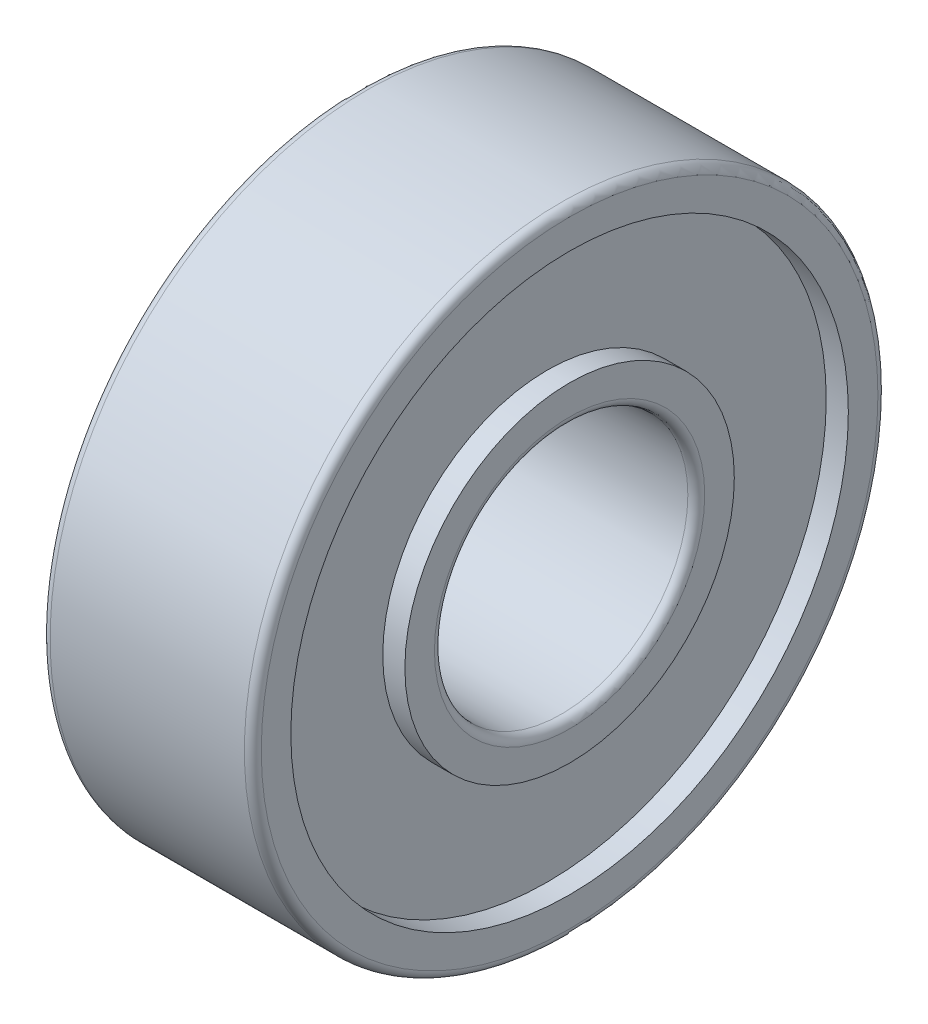
ISO-10303-21;
HEADER;
FILE_DESCRIPTION(('STEP AP214'),'2;1');
FILE_NAME('part.step','',(''),(''),'','','');
FILE_SCHEMA(('AUTOMOTIVE_DESIGN { 1 0 10303 214 1 1 1 1 }'));
ENDSEC;
DATA;
#1=APPLICATION_CONTEXT('core data for automotive mechanical design processes');
#2=APPLICATION_PROTOCOL_DEFINITION('international standard','automotive_design',2000,#1);
#3=PRODUCT_CONTEXT('',#1,'mechanical');
#4=PRODUCT('Part','Part','',(#3));
#5=PRODUCT_RELATED_PRODUCT_CATEGORY('part','',(#4));
#6=PRODUCT_DEFINITION_FORMATION('','',#4);
#7=PRODUCT_DEFINITION_CONTEXT('part definition',#1,'design');
#8=PRODUCT_DEFINITION('design','',#6,#7);
#9=PRODUCT_DEFINITION_SHAPE('','',#8);
#10=(LENGTH_UNIT() NAMED_UNIT(*) SI_UNIT(.MILLI.,.METRE.));
#11=(NAMED_UNIT(*) PLANE_ANGLE_UNIT() SI_UNIT($,.RADIAN.));
#12=(NAMED_UNIT(*) SI_UNIT($,.STERADIAN.) SOLID_ANGLE_UNIT());
#13=UNCERTAINTY_MEASURE_WITH_UNIT(LENGTH_MEASURE(1.E-05),#10,'distance_accuracy_value','');
#14=(GEOMETRIC_REPRESENTATION_CONTEXT(3) GLOBAL_UNCERTAINTY_ASSIGNED_CONTEXT((#13)) GLOBAL_UNIT_ASSIGNED_CONTEXT((#10,
#11,#12)) REPRESENTATION_CONTEXT('',''));
#15=CARTESIAN_POINT('',(0.,0.,0.));
#16=DIRECTION('',(0.,0.,1.));
#17=DIRECTION('',(1.,0.,0.));
#18=AXIS2_PLACEMENT_3D('',#15,#16,#17);
#19=CARTESIAN_POINT('',(-0.00134979776492058,0.,0.));
#20=DIRECTION('',(1.,0.,0.));
#21=DIRECTION('',(0.,0.,-1.));
#22=AXIS2_PLACEMENT_3D('',#19,#20,#21);
#23=CYLINDRICAL_SURFACE('',#22,3.9);
#24=CARTESIAN_POINT('',(0.,0.,0.));
#25=DIRECTION('',(1.,0.,0.));
#26=DIRECTION('',(0.,0.,-1.));
#27=AXIS2_PLACEMENT_3D('',#24,#25,#26);
#28=CIRCLE('',#27,3.9);
#29=CARTESIAN_POINT('',(0.,0.,-3.9));
#30=VERTEX_POINT('',#29);
#31=EDGE_CURVE('E10',#30,#30,#28,.T.);
#32=ORIENTED_EDGE('',*,*,#31,.T.);
#33=EDGE_LOOP('',(#32));
#34=FACE_BOUND('',#33,.T.);
#35=CARTESIAN_POINT('',(0.5235,0.,0.));
#36=DIRECTION('',(1.,0.,0.));
#37=DIRECTION('',(0.,0.,-1.));
#38=AXIS2_PLACEMENT_3D('',#35,#36,#37);
#39=CIRCLE('',#38,3.9);
#40=CARTESIAN_POINT('',(0.5235,0.,-3.9));
#41=VERTEX_POINT('',#40);
#42=EDGE_CURVE('E82',#41,#41,#39,.T.);
#43=ORIENTED_EDGE('',*,*,#42,.F.);
#44=EDGE_LOOP('',(#43));
#45=FACE_BOUND('',#44,.T.);
#46=ADVANCED_FACE('F30',(#34,#45),#23,.T.);
#47=CARTESIAN_POINT('',(0.,3.9,0.));
#48=DIRECTION('',(-1.,0.,0.));
#49=DIRECTION('',(0.,0.,1.));
#50=AXIS2_PLACEMENT_3D('',#47,#48,#49);
#51=PLANE('',#50);
#52=CARTESIAN_POINT('',(0.,0.,0.));
#53=DIRECTION('',(1.,0.,0.));
#54=DIRECTION('',(0.,0.,-1.));
#55=AXIS2_PLACEMENT_3D('',#52,#53,#54);
#56=CIRCLE('',#55,3.2);
#57=CARTESIAN_POINT('',(0.,0.,-3.2));
#58=VERTEX_POINT('',#57);
#59=EDGE_CURVE('E36',#58,#58,#56,.T.);
#60=ORIENTED_EDGE('',*,*,#59,.T.);
#61=EDGE_LOOP('',(#60));
#62=FACE_BOUND('',#61,.T.);
#63=ORIENTED_EDGE('',*,*,#31,.F.);
#64=EDGE_LOOP('',(#63));
#65=FACE_BOUND('',#64,.T.);
#66=ADVANCED_FACE('F90',(#62,#65),#51,.T.);
#67=CARTESIAN_POINT('',(0.200000000000015,0.,0.));
#68=DIRECTION('',(1.,0.,0.));
#69=DIRECTION('',(0.,0.,-1.));
#70=AXIS2_PLACEMENT_3D('',#67,#68,#69);
#71=TOROIDAL_SURFACE('',#70,3.2,0.200000000000016);
#72=CARTESIAN_POINT('',(0.2,0.,0.));
#73=DIRECTION('',(1.,0.,0.));
#74=DIRECTION('',(0.,0.,-1.));
#75=AXIS2_PLACEMENT_3D('',#72,#73,#74);
#76=CIRCLE('',#75,2.99999999999998);
#77=CARTESIAN_POINT('',(0.2,0.,-2.99999999999998));
#78=VERTEX_POINT('',#77);
#79=EDGE_CURVE('E40',#78,#78,#76,.T.);
#80=ORIENTED_EDGE('',*,*,#79,.T.);
#81=EDGE_LOOP('',(#80));
#82=FACE_BOUND('',#81,.T.);
#83=ORIENTED_EDGE('',*,*,#59,.F.);
#84=EDGE_LOOP('',(#83));
#85=FACE_BOUND('',#84,.T.);
#86=ADVANCED_FACE('F94',(#82,#85),#71,.T.);
#87=CARTESIAN_POINT('',(-0.00134979776492058,0.,0.));
#88=DIRECTION('',(1.,0.,0.));
#89=DIRECTION('',(0.,0.,-1.));
#90=AXIS2_PLACEMENT_3D('',#87,#88,#89);
#91=CYLINDRICAL_SURFACE('',#90,2.99999999999999);
#92=CARTESIAN_POINT('',(4.8,0.,0.));
#93=DIRECTION('',(1.,0.,0.));
#94=DIRECTION('',(0.,0.,-1.));
#95=AXIS2_PLACEMENT_3D('',#92,#93,#94);
#96=CIRCLE('',#95,3.);
#97=CARTESIAN_POINT('',(4.8,0.,-3.));
#98=VERTEX_POINT('',#97);
#99=EDGE_CURVE('E44',#98,#98,#96,.T.);
#100=ORIENTED_EDGE('',*,*,#99,.T.);
#101=EDGE_LOOP('',(#100));
#102=FACE_BOUND('',#101,.T.);
#103=ORIENTED_EDGE('',*,*,#79,.F.);
#104=EDGE_LOOP('',(#103));
#105=FACE_BOUND('',#104,.T.);
#106=ADVANCED_FACE('F98',(#102,#105),#91,.F.);
#107=CARTESIAN_POINT('',(4.8,0.,0.));
#108=DIRECTION('',(1.,0.,0.));
#109=DIRECTION('',(0.,0.,-1.));
#110=AXIS2_PLACEMENT_3D('',#107,#108,#109);
#111=TOROIDAL_SURFACE('',#110,3.2,0.200000000000016);
#112=CARTESIAN_POINT('',(5.00000000000002,0.,0.));
#113=DIRECTION('',(1.,0.,0.));
#114=DIRECTION('',(0.,0.,-1.));
#115=AXIS2_PLACEMENT_3D('',#112,#113,#114);
#116=CIRCLE('',#115,3.2);
#117=CARTESIAN_POINT('',(5.00000000000002,0.,-3.2));
#118=VERTEX_POINT('',#117);
#119=EDGE_CURVE('E49',#118,#118,#116,.T.);
#120=ORIENTED_EDGE('',*,*,#119,.T.);
#121=EDGE_LOOP('',(#120));
#122=FACE_BOUND('',#121,.T.);
#123=ORIENTED_EDGE('',*,*,#99,.F.);
#124=EDGE_LOOP('',(#123));
#125=FACE_BOUND('',#124,.T.);
#126=ADVANCED_FACE('F105',(#122,#125),#111,.T.);
#127=CARTESIAN_POINT('',(5.00000000000001,3.2,0.));
#128=DIRECTION('',(1.,0.,0.));
#129=DIRECTION('',(0.,0.,-1.));
#130=AXIS2_PLACEMENT_3D('',#127,#128,#129);
#131=PLANE('',#130);
#132=CARTESIAN_POINT('',(5.,0.,0.));
#133=DIRECTION('',(1.,0.,0.));
#134=DIRECTION('',(0.,0.,-1.));
#135=AXIS2_PLACEMENT_3D('',#132,#133,#134);
#136=CIRCLE('',#135,3.9);
#137=CARTESIAN_POINT('',(5.,0.,-3.9));
#138=VERTEX_POINT('',#137);
#139=EDGE_CURVE('E52',#138,#138,#136,.T.);
#140=ORIENTED_EDGE('',*,*,#139,.T.);
#141=EDGE_LOOP('',(#140));
#142=FACE_BOUND('',#141,.T.);
#143=ORIENTED_EDGE('',*,*,#119,.F.);
#144=EDGE_LOOP('',(#143));
#145=FACE_BOUND('',#144,.T.);
#146=ADVANCED_FACE('F109',(#142,#145),#131,.T.);
#147=CARTESIAN_POINT('',(-0.00134979776492058,0.,0.));
#148=DIRECTION('',(1.,0.,0.));
#149=DIRECTION('',(0.,0.,-1.));
#150=AXIS2_PLACEMENT_3D('',#147,#148,#149);
#151=CYLINDRICAL_SURFACE('',#150,3.9);
#152=CARTESIAN_POINT('',(4.4765,0.,0.));
#153=DIRECTION('',(1.,0.,0.));
#154=DIRECTION('',(0.,0.,-1.));
#155=AXIS2_PLACEMENT_3D('',#152,#153,#154);
#156=CIRCLE('',#155,3.9);
#157=CARTESIAN_POINT('',(4.4765,0.,-3.9));
#158=VERTEX_POINT('',#157);
#159=EDGE_CURVE('E55',#158,#158,#156,.T.);
#160=ORIENTED_EDGE('',*,*,#159,.T.);
#161=EDGE_LOOP('',(#160));
#162=FACE_BOUND('',#161,.T.);
#163=ORIENTED_EDGE('',*,*,#139,.F.);
#164=EDGE_LOOP('',(#163));
#165=FACE_BOUND('',#164,.T.);
#166=ADVANCED_FACE('F113',(#162,#165),#151,.T.);
#167=CARTESIAN_POINT('',(4.4765,3.9,0.));
#168=DIRECTION('',(1.,0.,0.));
#169=DIRECTION('',(0.,0.,-1.));
#170=AXIS2_PLACEMENT_3D('',#167,#168,#169);
#171=PLANE('',#170);
#172=CARTESIAN_POINT('',(4.4765,0.,0.));
#173=DIRECTION('',(1.,0.,0.));
#174=DIRECTION('',(0.,0.,-1.));
#175=AXIS2_PLACEMENT_3D('',#172,#173,#174);
#176=CIRCLE('',#175,6.6);
#177=CARTESIAN_POINT('',(4.4765,0.,-6.6));
#178=VERTEX_POINT('',#177);
#179=EDGE_CURVE('E58',#178,#178,#176,.T.);
#180=ORIENTED_EDGE('',*,*,#179,.T.);
#181=EDGE_LOOP('',(#180));
#182=FACE_BOUND('',#181,.T.);
#183=ORIENTED_EDGE('',*,*,#159,.F.);
#184=EDGE_LOOP('',(#183));
#185=FACE_BOUND('',#184,.T.);
#186=ADVANCED_FACE('F117',(#182,#185),#171,.T.);
#187=CARTESIAN_POINT('',(-0.00134979776492058,0.,0.));
#188=DIRECTION('',(1.,0.,0.));
#189=DIRECTION('',(0.,0.,-1.));
#190=AXIS2_PLACEMENT_3D('',#187,#188,#189);
#191=CYLINDRICAL_SURFACE('',#190,6.6);
#192=CARTESIAN_POINT('',(5.,0.,0.));
#193=DIRECTION('',(1.,0.,0.));
#194=DIRECTION('',(0.,0.,-1.));
#195=AXIS2_PLACEMENT_3D('',#192,#193,#194);
#196=CIRCLE('',#195,6.6);
#197=CARTESIAN_POINT('',(5.,0.,-6.6));
#198=VERTEX_POINT('',#197);
#199=EDGE_CURVE('E61',#198,#198,#196,.T.);
#200=ORIENTED_EDGE('',*,*,#199,.T.);
#201=EDGE_LOOP('',(#200));
#202=FACE_BOUND('',#201,.T.);
#203=ORIENTED_EDGE('',*,*,#179,.F.);
#204=EDGE_LOOP('',(#203));
#205=FACE_BOUND('',#204,.T.);
#206=ADVANCED_FACE('F121',(#202,#205),#191,.F.);
#207=CARTESIAN_POINT('',(5.00000000000002,6.6,0.));
#208=DIRECTION('',(1.,0.,0.));
#209=DIRECTION('',(0.,0.,-1.));
#210=AXIS2_PLACEMENT_3D('',#207,#208,#209);
#211=PLANE('',#210);
#212=CARTESIAN_POINT('',(5.00000000000003,0.,0.));
#213=DIRECTION('',(1.,0.,0.));
#214=DIRECTION('',(0.,0.,-1.));
#215=AXIS2_PLACEMENT_3D('',#212,#213,#214);
#216=CIRCLE('',#215,7.3);
#217=CARTESIAN_POINT('',(5.00000000000003,0.,-7.3));
#218=VERTEX_POINT('',#217);
#219=EDGE_CURVE('E64',#218,#218,#216,.T.);
#220=ORIENTED_EDGE('',*,*,#219,.T.);
#221=EDGE_LOOP('',(#220));
#222=FACE_BOUND('',#221,.T.);
#223=ORIENTED_EDGE('',*,*,#199,.F.);
#224=EDGE_LOOP('',(#223));
#225=FACE_BOUND('',#224,.T.);
#226=ADVANCED_FACE('F125',(#222,#225),#211,.T.);
#227=CARTESIAN_POINT('',(4.8,0.,0.));
#228=DIRECTION('',(1.,0.,0.));
#229=DIRECTION('',(0.,0.,-1.));
#230=AXIS2_PLACEMENT_3D('',#227,#228,#229);
#231=TOROIDAL_SURFACE('',#230,7.3,0.200000000000023);
#232=CARTESIAN_POINT('',(4.8,0.,0.));
#233=DIRECTION('',(1.,0.,0.));
#234=DIRECTION('',(0.,0.,-1.));
#235=AXIS2_PLACEMENT_3D('',#232,#233,#234);
#236=CIRCLE('',#235,7.50000000000002);
#237=CARTESIAN_POINT('',(4.8,0.,-7.50000000000002));
#238=VERTEX_POINT('',#237);
#239=EDGE_CURVE('E67',#238,#238,#236,.T.);
#240=ORIENTED_EDGE('',*,*,#239,.T.);
#241=EDGE_LOOP('',(#240));
#242=FACE_BOUND('',#241,.T.);
#243=ORIENTED_EDGE('',*,*,#219,.F.);
#244=EDGE_LOOP('',(#243));
#245=FACE_BOUND('',#244,.T.);
#246=ADVANCED_FACE('F129',(#242,#245),#231,.T.);
#247=CARTESIAN_POINT('',(-0.00134979776492058,0.,0.));
#248=DIRECTION('',(1.,0.,0.));
#249=DIRECTION('',(0.,0.,-1.));
#250=AXIS2_PLACEMENT_3D('',#247,#248,#249);
#251=CYLINDRICAL_SURFACE('',#250,7.50000000000001);
#252=CARTESIAN_POINT('',(0.2,0.,0.));
#253=DIRECTION('',(1.,0.,0.));
#254=DIRECTION('',(0.,0.,-1.));
#255=AXIS2_PLACEMENT_3D('',#252,#253,#254);
#256=CIRCLE('',#255,7.5);
#257=CARTESIAN_POINT('',(0.2,0.,-7.5));
#258=VERTEX_POINT('',#257);
#259=EDGE_CURVE('E70',#258,#258,#256,.T.);
#260=ORIENTED_EDGE('',*,*,#259,.T.);
#261=EDGE_LOOP('',(#260));
#262=FACE_BOUND('',#261,.T.);
#263=ORIENTED_EDGE('',*,*,#239,.F.);
#264=EDGE_LOOP('',(#263));
#265=FACE_BOUND('',#264,.T.);
#266=ADVANCED_FACE('F133',(#262,#265),#251,.T.);
#267=CARTESIAN_POINT('',(0.200000000000016,0.,0.));
#268=DIRECTION('',(1.,0.,0.));
#269=DIRECTION('',(0.,0.,-1.));
#270=AXIS2_PLACEMENT_3D('',#267,#268,#269);
#271=TOROIDAL_SURFACE('',#270,7.3,0.200000000000008);
#272=CARTESIAN_POINT('',(0.,0.,0.));
#273=DIRECTION('',(1.,0.,0.));
#274=DIRECTION('',(0.,0.,-1.));
#275=AXIS2_PLACEMENT_3D('',#272,#273,#274);
#276=CIRCLE('',#275,7.3);
#277=CARTESIAN_POINT('',(0.,0.,-7.3));
#278=VERTEX_POINT('',#277);
#279=EDGE_CURVE('E73',#278,#278,#276,.T.);
#280=ORIENTED_EDGE('',*,*,#279,.T.);
#281=EDGE_LOOP('',(#280));
#282=FACE_BOUND('',#281,.T.);
#283=ORIENTED_EDGE('',*,*,#259,.F.);
#284=EDGE_LOOP('',(#283));
#285=FACE_BOUND('',#284,.T.);
#286=ADVANCED_FACE('F137',(#282,#285),#271,.T.);
#287=CARTESIAN_POINT('',(0.,7.3,0.));
#288=DIRECTION('',(-1.,0.,0.));
#289=DIRECTION('',(0.,0.,1.));
#290=AXIS2_PLACEMENT_3D('',#287,#288,#289);
#291=PLANE('',#290);
#292=CARTESIAN_POINT('',(0.,0.,0.));
#293=DIRECTION('',(1.,0.,0.));
#294=DIRECTION('',(0.,0.,-1.));
#295=AXIS2_PLACEMENT_3D('',#292,#293,#294);
#296=CIRCLE('',#295,6.6);
#297=CARTESIAN_POINT('',(0.,0.,-6.6));
#298=VERTEX_POINT('',#297);
#299=EDGE_CURVE('E76',#298,#298,#296,.T.);
#300=ORIENTED_EDGE('',*,*,#299,.T.);
#301=EDGE_LOOP('',(#300));
#302=FACE_BOUND('',#301,.T.);
#303=ORIENTED_EDGE('',*,*,#279,.F.);
#304=EDGE_LOOP('',(#303));
#305=FACE_BOUND('',#304,.T.);
#306=ADVANCED_FACE('F141',(#302,#305),#291,.T.);
#307=CARTESIAN_POINT('',(-0.00134979776492058,0.,0.));
#308=DIRECTION('',(1.,0.,0.));
#309=DIRECTION('',(0.,0.,-1.));
#310=AXIS2_PLACEMENT_3D('',#307,#308,#309);
#311=CYLINDRICAL_SURFACE('',#310,6.6);
#312=CARTESIAN_POINT('',(0.523500000000001,0.,0.));
#313=DIRECTION('',(1.,0.,0.));
#314=DIRECTION('',(0.,0.,-1.));
#315=AXIS2_PLACEMENT_3D('',#312,#313,#314);
#316=CIRCLE('',#315,6.6);
#317=CARTESIAN_POINT('',(0.523500000000001,0.,-6.6));
#318=VERTEX_POINT('',#317);
#319=EDGE_CURVE('E79',#318,#318,#316,.T.);
#320=ORIENTED_EDGE('',*,*,#319,.T.);
#321=EDGE_LOOP('',(#320));
#322=FACE_BOUND('',#321,.T.);
#323=ORIENTED_EDGE('',*,*,#299,.F.);
#324=EDGE_LOOP('',(#323));
#325=FACE_BOUND('',#324,.T.);
#326=ADVANCED_FACE('F145',(#322,#325),#311,.F.);
#327=CARTESIAN_POINT('',(0.5235,6.6,0.));
#328=DIRECTION('',(-1.,0.,0.));
#329=DIRECTION('',(0.,0.,1.));
#330=AXIS2_PLACEMENT_3D('',#327,#328,#329);
#331=PLANE('',#330);
#332=ORIENTED_EDGE('',*,*,#42,.T.);
#333=EDGE_LOOP('',(#332));
#334=FACE_BOUND('',#333,.T.);
#335=ORIENTED_EDGE('',*,*,#319,.F.);
#336=EDGE_LOOP('',(#335));
#337=FACE_BOUND('',#336,.T.);
#338=ADVANCED_FACE('F86',(#334,#337),#331,.T.);
#339=CLOSED_SHELL('',(#46,#66,#86,#106,#126,#146,#166,#186,#206,#226,#246,#266,#286,#306,#326,#338));
#340=MANIFOLD_SOLID_BREP('B2',#339);
#341=ADVANCED_BREP_SHAPE_REPRESENTATION('',(#18,#340),#14);
#342=SHAPE_DEFINITION_REPRESENTATION(#9,#341);
ENDSEC;
END-ISO-10303-21;
